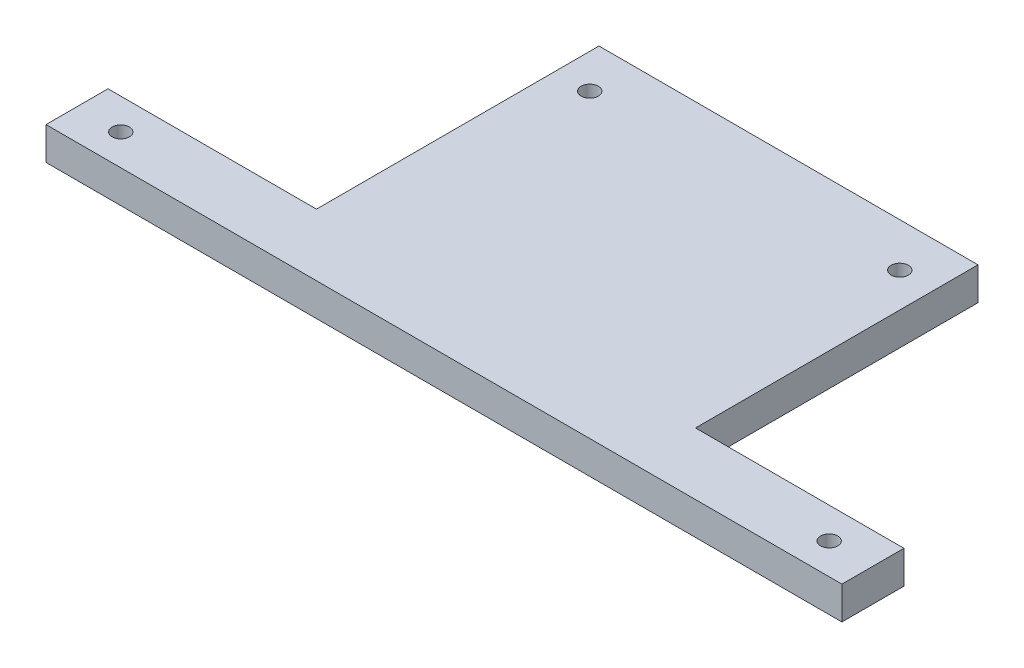
ISO-10303-21;
HEADER;
FILE_DESCRIPTION(('STEP AP214'),'2;1');
FILE_NAME('part.step','',(''),(''),'','','');
FILE_SCHEMA(('AUTOMOTIVE_DESIGN { 1 0 10303 214 1 1 1 1 }'));
ENDSEC;
DATA;
#1=APPLICATION_CONTEXT('core data for automotive mechanical design processes');
#2=APPLICATION_PROTOCOL_DEFINITION('international standard','automotive_design',2000,#1);
#3=PRODUCT_CONTEXT('',#1,'mechanical');
#4=PRODUCT('Part','Part','',(#3));
#5=PRODUCT_RELATED_PRODUCT_CATEGORY('part','',(#4));
#6=PRODUCT_DEFINITION_FORMATION('','',#4);
#7=PRODUCT_DEFINITION_CONTEXT('part definition',#1,'design');
#8=PRODUCT_DEFINITION('design','',#6,#7);
#9=PRODUCT_DEFINITION_SHAPE('','',#8);
#10=(LENGTH_UNIT() NAMED_UNIT(*) SI_UNIT(.MILLI.,.METRE.));
#11=(NAMED_UNIT(*) PLANE_ANGLE_UNIT() SI_UNIT($,.RADIAN.));
#12=(NAMED_UNIT(*) SI_UNIT($,.STERADIAN.) SOLID_ANGLE_UNIT());
#13=UNCERTAINTY_MEASURE_WITH_UNIT(LENGTH_MEASURE(1.E-05),#10,'distance_accuracy_value','');
#14=(GEOMETRIC_REPRESENTATION_CONTEXT(3) GLOBAL_UNCERTAINTY_ASSIGNED_CONTEXT((#13)) GLOBAL_UNIT_ASSIGNED_CONTEXT((#10,
#11,#12)) REPRESENTATION_CONTEXT('',''));
#15=CARTESIAN_POINT('',(0.,0.,0.));
#16=DIRECTION('',(0.,0.,1.));
#17=DIRECTION('',(1.,0.,0.));
#18=AXIS2_PLACEMENT_3D('',#15,#16,#17);
#19=CARTESIAN_POINT('',(-115.5,4.7625,0.999999999999994));
#20=DIRECTION('',(0.,0.,1.));
#21=DIRECTION('',(1.,0.,0.));
#22=AXIS2_PLACEMENT_3D('',#19,#20,#21);
#23=PLANE('',#22);
#24=DIRECTION('',(-1.,0.,0.));
#25=VECTOR('',#24,1.);
#26=CARTESIAN_POINT('',(-115.5,-4.7625,0.999999999999994));
#27=LINE('',#26,#25);
#28=CARTESIAN_POINT('',(-55.,-4.7625,1.));
#29=VERTEX_POINT('',#28);
#30=CARTESIAN_POINT('',(-115.5,-4.7625,0.999999999999994));
#31=VERTEX_POINT('',#30);
#32=EDGE_CURVE('E129',#29,#31,#27,.T.);
#33=ORIENTED_EDGE('',*,*,#32,.T.);
#34=DIRECTION('',(0.,-1.,0.));
#35=VECTOR('',#34,1.);
#36=CARTESIAN_POINT('',(-115.5,4.7625,0.999999999999994));
#37=LINE('',#36,#35);
#38=CARTESIAN_POINT('',(-115.5,4.7625,0.999999999999994));
#39=VERTEX_POINT('',#38);
#40=EDGE_CURVE('E11',#39,#31,#37,.T.);
#41=ORIENTED_EDGE('',*,*,#40,.F.);
#42=DIRECTION('',(-1.,0.,0.));
#43=VECTOR('',#42,1.);
#44=CARTESIAN_POINT('',(-115.5,4.7625,0.999999999999994));
#45=LINE('',#44,#43);
#46=CARTESIAN_POINT('',(-55.,4.7625,1.));
#47=VERTEX_POINT('',#46);
#48=EDGE_CURVE('E144',#47,#39,#45,.T.);
#49=ORIENTED_EDGE('',*,*,#48,.F.);
#50=DIRECTION('',(0.,-1.,0.));
#51=VECTOR('',#50,1.);
#52=CARTESIAN_POINT('',(-55.,4.7625,1.));
#53=LINE('',#52,#51);
#54=EDGE_CURVE('E125',#47,#29,#53,.T.);
#55=ORIENTED_EDGE('',*,*,#54,.T.);
#56=EDGE_LOOP('',(#33,#41,#49,#55));
#57=FACE_BOUND('',#56,.T.);
#58=ADVANCED_FACE('F33',(#57),#23,.F.);
#59=CARTESIAN_POINT('',(-115.5,4.7625,19.));
#60=DIRECTION('',(1.,0.,0.));
#61=DIRECTION('',(0.,0.,-1.));
#62=AXIS2_PLACEMENT_3D('',#59,#60,#61);
#63=PLANE('',#62);
#64=DIRECTION('',(0.,0.,1.));
#65=VECTOR('',#64,1.);
#66=CARTESIAN_POINT('',(-115.5,-4.7625,19.));
#67=LINE('',#66,#65);
#68=CARTESIAN_POINT('',(-115.5,-4.7625,19.));
#69=VERTEX_POINT('',#68);
#70=EDGE_CURVE('E132',#31,#69,#67,.T.);
#71=ORIENTED_EDGE('',*,*,#70,.T.);
#72=DIRECTION('',(0.,-1.,0.));
#73=VECTOR('',#72,1.);
#74=CARTESIAN_POINT('',(-115.5,4.7625,19.));
#75=LINE('',#74,#73);
#76=CARTESIAN_POINT('',(-115.5,4.7625,19.));
#77=VERTEX_POINT('',#76);
#78=EDGE_CURVE('E41',#77,#69,#75,.T.);
#79=ORIENTED_EDGE('',*,*,#78,.F.);
#80=DIRECTION('',(0.,0.,1.));
#81=VECTOR('',#80,1.);
#82=CARTESIAN_POINT('',(-115.5,4.7625,19.));
#83=LINE('',#82,#81);
#84=EDGE_CURVE('E92',#39,#77,#83,.T.);
#85=ORIENTED_EDGE('',*,*,#84,.F.);
#86=ORIENTED_EDGE('',*,*,#40,.T.);
#87=EDGE_LOOP('',(#71,#79,#85,#86));
#88=FACE_BOUND('',#87,.T.);
#89=ADVANCED_FACE('F229',(#88),#63,.F.);
#90=CARTESIAN_POINT('',(115.5,4.7625,19.));
#91=DIRECTION('',(0.,0.,-1.));
#92=DIRECTION('',(-1.,0.,0.));
#93=AXIS2_PLACEMENT_3D('',#90,#91,#92);
#94=PLANE('',#93);
#95=DIRECTION('',(1.,0.,0.));
#96=VECTOR('',#95,1.);
#97=CARTESIAN_POINT('',(115.5,-4.7625,19.));
#98=LINE('',#97,#96);
#99=CARTESIAN_POINT('',(115.5,-4.7625,19.));
#100=VERTEX_POINT('',#99);
#101=EDGE_CURVE('E135',#69,#100,#98,.T.);
#102=ORIENTED_EDGE('',*,*,#101,.T.);
#103=DIRECTION('',(0.,-1.,0.));
#104=VECTOR('',#103,1.);
#105=CARTESIAN_POINT('',(115.5,4.7625,19.));
#106=LINE('',#105,#104);
#107=CARTESIAN_POINT('',(115.5,4.7625,19.));
#108=VERTEX_POINT('',#107);
#109=EDGE_CURVE('E151',#108,#100,#106,.T.);
#110=ORIENTED_EDGE('',*,*,#109,.F.);
#111=DIRECTION('',(1.,0.,0.));
#112=VECTOR('',#111,1.);
#113=CARTESIAN_POINT('',(115.5,4.7625,19.));
#114=LINE('',#113,#112);
#115=EDGE_CURVE('E159',#77,#108,#114,.T.);
#116=ORIENTED_EDGE('',*,*,#115,.F.);
#117=ORIENTED_EDGE('',*,*,#78,.T.);
#118=EDGE_LOOP('',(#102,#110,#116,#117));
#119=FACE_BOUND('',#118,.T.);
#120=ADVANCED_FACE('F157',(#119),#94,.F.);
#121=CARTESIAN_POINT('',(115.5,4.7625,0.999999999999994));
#122=DIRECTION('',(-1.,0.,0.));
#123=DIRECTION('',(0.,0.,1.));
#124=AXIS2_PLACEMENT_3D('',#121,#122,#123);
#125=PLANE('',#124);
#126=DIRECTION('',(0.,0.,-1.));
#127=VECTOR('',#126,1.);
#128=CARTESIAN_POINT('',(115.5,-4.7625,0.999999999999994));
#129=LINE('',#128,#127);
#130=CARTESIAN_POINT('',(115.5,-4.7625,0.999999999999994));
#131=VERTEX_POINT('',#130);
#132=EDGE_CURVE('E137',#100,#131,#129,.T.);
#133=ORIENTED_EDGE('',*,*,#132,.T.);
#134=DIRECTION('',(0.,-1.,0.));
#135=VECTOR('',#134,1.);
#136=CARTESIAN_POINT('',(115.5,4.7625,0.999999999999994));
#137=LINE('',#136,#135);
#138=CARTESIAN_POINT('',(115.5,4.7625,0.999999999999994));
#139=VERTEX_POINT('',#138);
#140=EDGE_CURVE('E148',#139,#131,#137,.T.);
#141=ORIENTED_EDGE('',*,*,#140,.F.);
#142=DIRECTION('',(0.,0.,-1.));
#143=VECTOR('',#142,1.);
#144=CARTESIAN_POINT('',(115.5,4.7625,0.999999999999994));
#145=LINE('',#144,#143);
#146=EDGE_CURVE('E171',#108,#139,#145,.T.);
#147=ORIENTED_EDGE('',*,*,#146,.F.);
#148=ORIENTED_EDGE('',*,*,#109,.T.);
#149=EDGE_LOOP('',(#133,#141,#147,#148));
#150=FACE_BOUND('',#149,.T.);
#151=ADVANCED_FACE('F167',(#150),#125,.F.);
#152=CARTESIAN_POINT('',(55.,4.7625,0.999999999999977));
#153=DIRECTION('',(0.,0.,1.));
#154=DIRECTION('',(1.,0.,0.));
#155=AXIS2_PLACEMENT_3D('',#152,#153,#154);
#156=PLANE('',#155);
#157=DIRECTION('',(-1.,0.,0.));
#158=VECTOR('',#157,1.);
#159=CARTESIAN_POINT('',(55.,-4.7625,0.999999999999977));
#160=LINE('',#159,#158);
#161=CARTESIAN_POINT('',(55.,-4.7625,0.999999999999977));
#162=VERTEX_POINT('',#161);
#163=EDGE_CURVE('E139',#131,#162,#160,.T.);
#164=ORIENTED_EDGE('',*,*,#163,.T.);
#165=DIRECTION('',(0.,-1.,0.));
#166=VECTOR('',#165,1.);
#167=CARTESIAN_POINT('',(55.,4.7625,0.999999999999977));
#168=LINE('',#167,#166);
#169=CARTESIAN_POINT('',(55.,4.7625,0.999999999999977));
#170=VERTEX_POINT('',#169);
#171=EDGE_CURVE('E120',#170,#162,#168,.T.);
#172=ORIENTED_EDGE('',*,*,#171,.F.);
#173=DIRECTION('',(-1.,0.,0.));
#174=VECTOR('',#173,1.);
#175=CARTESIAN_POINT('',(55.,4.7625,0.999999999999977));
#176=LINE('',#175,#174);
#177=EDGE_CURVE('E111',#139,#170,#176,.T.);
#178=ORIENTED_EDGE('',*,*,#177,.F.);
#179=ORIENTED_EDGE('',*,*,#140,.T.);
#180=EDGE_LOOP('',(#164,#172,#178,#179));
#181=FACE_BOUND('',#180,.T.);
#182=ADVANCED_FACE('F170',(#181),#156,.F.);
#183=CARTESIAN_POINT('',(55.,4.7625,-81.));
#184=DIRECTION('',(-1.,0.,0.));
#185=DIRECTION('',(0.,0.,1.));
#186=AXIS2_PLACEMENT_3D('',#183,#184,#185);
#187=PLANE('',#186);
#188=DIRECTION('',(0.,0.,-1.));
#189=VECTOR('',#188,1.);
#190=CARTESIAN_POINT('',(55.,-4.7625,-81.));
#191=LINE('',#190,#189);
#192=CARTESIAN_POINT('',(55.,-4.7625,-81.));
#193=VERTEX_POINT('',#192);
#194=EDGE_CURVE('E119',#162,#193,#191,.T.);
#195=ORIENTED_EDGE('',*,*,#194,.T.);
#196=DIRECTION('',(0.,-1.,0.));
#197=VECTOR('',#196,1.);
#198=CARTESIAN_POINT('',(55.,4.7625,-81.));
#199=LINE('',#198,#197);
#200=CARTESIAN_POINT('',(55.,4.7625,-81.));
#201=VERTEX_POINT('',#200);
#202=EDGE_CURVE('E116',#201,#193,#199,.T.);
#203=ORIENTED_EDGE('',*,*,#202,.F.);
#204=DIRECTION('',(0.,0.,-1.));
#205=VECTOR('',#204,1.);
#206=CARTESIAN_POINT('',(55.,4.7625,-81.));
#207=LINE('',#206,#205);
#208=EDGE_CURVE('E105',#170,#201,#207,.T.);
#209=ORIENTED_EDGE('',*,*,#208,.F.);
#210=ORIENTED_EDGE('',*,*,#171,.T.);
#211=EDGE_LOOP('',(#195,#203,#209,#210));
#212=FACE_BOUND('',#211,.T.);
#213=ADVANCED_FACE('F117',(#212),#187,.F.);
#214=CARTESIAN_POINT('',(-55.,4.7625,-81.));
#215=DIRECTION('',(0.,0.,1.));
#216=DIRECTION('',(1.,0.,0.));
#217=AXIS2_PLACEMENT_3D('',#214,#215,#216);
#218=PLANE('',#217);
#219=DIRECTION('',(-1.,0.,0.));
#220=VECTOR('',#219,1.);
#221=CARTESIAN_POINT('',(-55.,-4.7625,-81.));
#222=LINE('',#221,#220);
#223=CARTESIAN_POINT('',(-55.,-4.7625,-81.));
#224=VERTEX_POINT('',#223);
#225=EDGE_CURVE('E78',#193,#224,#222,.T.);
#226=ORIENTED_EDGE('',*,*,#225,.T.);
#227=DIRECTION('',(0.,-1.,0.));
#228=VECTOR('',#227,1.);
#229=CARTESIAN_POINT('',(-55.,4.7625,-81.));
#230=LINE('',#229,#228);
#231=CARTESIAN_POINT('',(-55.,4.7625,-81.));
#232=VERTEX_POINT('',#231);
#233=EDGE_CURVE('E121',#232,#224,#230,.T.);
#234=ORIENTED_EDGE('',*,*,#233,.F.);
#235=DIRECTION('',(-1.,0.,0.));
#236=VECTOR('',#235,1.);
#237=CARTESIAN_POINT('',(-55.,4.7625,-81.));
#238=LINE('',#237,#236);
#239=EDGE_CURVE('E109',#201,#232,#238,.T.);
#240=ORIENTED_EDGE('',*,*,#239,.F.);
#241=ORIENTED_EDGE('',*,*,#202,.T.);
#242=EDGE_LOOP('',(#226,#234,#240,#241));
#243=FACE_BOUND('',#242,.T.);
#244=ADVANCED_FACE('F123',(#243),#218,.F.);
#245=CARTESIAN_POINT('',(-55.,4.7625,1.));
#246=DIRECTION('',(1.,0.,0.));
#247=DIRECTION('',(0.,0.,-1.));
#248=AXIS2_PLACEMENT_3D('',#245,#246,#247);
#249=PLANE('',#248);
#250=DIRECTION('',(0.,0.,1.));
#251=VECTOR('',#250,1.);
#252=CARTESIAN_POINT('',(-55.,-4.7625,1.));
#253=LINE('',#252,#251);
#254=EDGE_CURVE('E84',#224,#29,#253,.T.);
#255=ORIENTED_EDGE('',*,*,#254,.T.);
#256=ORIENTED_EDGE('',*,*,#54,.F.);
#257=DIRECTION('',(0.,0.,1.));
#258=VECTOR('',#257,1.);
#259=CARTESIAN_POINT('',(-55.,4.7625,1.));
#260=LINE('',#259,#258);
#261=EDGE_CURVE('E49',#232,#47,#260,.T.);
#262=ORIENTED_EDGE('',*,*,#261,.F.);
#263=ORIENTED_EDGE('',*,*,#233,.T.);
#264=EDGE_LOOP('',(#255,#256,#262,#263));
#265=FACE_BOUND('',#264,.T.);
#266=ADVANCED_FACE('F205',(#265),#249,.F.);
#267=CARTESIAN_POINT('',(0.,4.7625,0.));
#268=DIRECTION('',(0.,1.,0.));
#269=DIRECTION('',(0.,0.,1.));
#270=AXIS2_PLACEMENT_3D('',#267,#268,#269);
#271=PLANE('',#270);
#272=CARTESIAN_POINT('',(-45.,4.7625,-68.3));
#273=DIRECTION('',(0.,1.,0.));
#274=DIRECTION('',(0.,0.,1.));
#275=AXIS2_PLACEMENT_3D('',#272,#273,#274);
#276=CIRCLE('',#275,2.5);
#277=CARTESIAN_POINT('',(-45.,4.7625,-65.8));
#278=VERTEX_POINT('',#277);
#279=EDGE_CURVE('E197',#278,#278,#276,.T.);
#280=ORIENTED_EDGE('',*,*,#279,.F.);
#281=EDGE_LOOP('',(#280));
#282=FACE_BOUND('',#281,.T.);
#283=CARTESIAN_POINT('',(45.,4.7625,-68.3));
#284=DIRECTION('',(0.,1.,0.));
#285=DIRECTION('',(0.,0.,1.));
#286=AXIS2_PLACEMENT_3D('',#283,#284,#285);
#287=CIRCLE('',#286,2.5);
#288=CARTESIAN_POINT('',(45.,4.7625,-65.8));
#289=VERTEX_POINT('',#288);
#290=EDGE_CURVE('E191',#289,#289,#287,.T.);
#291=ORIENTED_EDGE('',*,*,#290,.F.);
#292=EDGE_LOOP('',(#291));
#293=FACE_BOUND('',#292,.T.);
#294=CARTESIAN_POINT('',(-102.8,4.7625,10.));
#295=DIRECTION('',(0.,1.,0.));
#296=DIRECTION('',(0.,0.,1.));
#297=AXIS2_PLACEMENT_3D('',#294,#295,#296);
#298=CIRCLE('',#297,2.5);
#299=CARTESIAN_POINT('',(-102.8,4.7625,12.5));
#300=VERTEX_POINT('',#299);
#301=EDGE_CURVE('E185',#300,#300,#298,.T.);
#302=ORIENTED_EDGE('',*,*,#301,.F.);
#303=EDGE_LOOP('',(#302));
#304=FACE_BOUND('',#303,.T.);
#305=CARTESIAN_POINT('',(102.8,4.7625,9.99999999999999));
#306=DIRECTION('',(0.,1.,0.));
#307=DIRECTION('',(0.,0.,1.));
#308=AXIS2_PLACEMENT_3D('',#305,#306,#307);
#309=CIRCLE('',#308,2.5);
#310=CARTESIAN_POINT('',(102.8,4.7625,12.5));
#311=VERTEX_POINT('',#310);
#312=EDGE_CURVE('E179',#311,#311,#309,.T.);
#313=ORIENTED_EDGE('',*,*,#312,.F.);
#314=EDGE_LOOP('',(#313));
#315=FACE_BOUND('',#314,.T.);
#316=ORIENTED_EDGE('',*,*,#48,.T.);
#317=ORIENTED_EDGE('',*,*,#84,.T.);
#318=ORIENTED_EDGE('',*,*,#115,.T.);
#319=ORIENTED_EDGE('',*,*,#146,.T.);
#320=ORIENTED_EDGE('',*,*,#177,.T.);
#321=ORIENTED_EDGE('',*,*,#208,.T.);
#322=ORIENTED_EDGE('',*,*,#239,.T.);
#323=ORIENTED_EDGE('',*,*,#261,.T.);
#324=EDGE_LOOP('',(#316,#317,#318,#319,#320,#321,#322,#323));
#325=FACE_BOUND('',#324,.T.);
#326=ADVANCED_FACE('F107',(#282,#293,#304,#315,#325),#271,.T.);
#327=CARTESIAN_POINT('',(0.,-4.7625,0.));
#328=DIRECTION('',(0.,1.,0.));
#329=DIRECTION('',(0.,0.,1.));
#330=AXIS2_PLACEMENT_3D('',#327,#328,#329);
#331=PLANE('',#330);
#332=CARTESIAN_POINT('',(-45.,-4.7625,-68.3));
#333=DIRECTION('',(0.,1.,0.));
#334=DIRECTION('',(0.,0.,1.));
#335=AXIS2_PLACEMENT_3D('',#332,#333,#334);
#336=CIRCLE('',#335,2.5);
#337=CARTESIAN_POINT('',(-45.,-4.7625,-65.8));
#338=VERTEX_POINT('',#337);
#339=EDGE_CURVE('E194',#338,#338,#336,.T.);
#340=ORIENTED_EDGE('',*,*,#339,.T.);
#341=EDGE_LOOP('',(#340));
#342=FACE_BOUND('',#341,.T.);
#343=CARTESIAN_POINT('',(45.,-4.7625,-68.3));
#344=DIRECTION('',(0.,1.,0.));
#345=DIRECTION('',(0.,0.,1.));
#346=AXIS2_PLACEMENT_3D('',#343,#344,#345);
#347=CIRCLE('',#346,2.5);
#348=CARTESIAN_POINT('',(45.,-4.7625,-65.8));
#349=VERTEX_POINT('',#348);
#350=EDGE_CURVE('E188',#349,#349,#347,.T.);
#351=ORIENTED_EDGE('',*,*,#350,.T.);
#352=EDGE_LOOP('',(#351));
#353=FACE_BOUND('',#352,.T.);
#354=CARTESIAN_POINT('',(-102.8,-4.7625,10.));
#355=DIRECTION('',(0.,1.,0.));
#356=DIRECTION('',(0.,0.,1.));
#357=AXIS2_PLACEMENT_3D('',#354,#355,#356);
#358=CIRCLE('',#357,2.5);
#359=CARTESIAN_POINT('',(-102.8,-4.7625,12.5));
#360=VERTEX_POINT('',#359);
#361=EDGE_CURVE('E182',#360,#360,#358,.T.);
#362=ORIENTED_EDGE('',*,*,#361,.T.);
#363=EDGE_LOOP('',(#362));
#364=FACE_BOUND('',#363,.T.);
#365=CARTESIAN_POINT('',(102.8,-4.7625,9.99999999999999));
#366=DIRECTION('',(0.,1.,0.));
#367=DIRECTION('',(0.,0.,1.));
#368=AXIS2_PLACEMENT_3D('',#365,#366,#367);
#369=CIRCLE('',#368,2.5);
#370=CARTESIAN_POINT('',(102.8,-4.7625,12.5));
#371=VERTEX_POINT('',#370);
#372=EDGE_CURVE('E133',#371,#371,#369,.T.);
#373=ORIENTED_EDGE('',*,*,#372,.T.);
#374=EDGE_LOOP('',(#373));
#375=FACE_BOUND('',#374,.T.);
#376=ORIENTED_EDGE('',*,*,#32,.F.);
#377=ORIENTED_EDGE('',*,*,#254,.F.);
#378=ORIENTED_EDGE('',*,*,#225,.F.);
#379=ORIENTED_EDGE('',*,*,#194,.F.);
#380=ORIENTED_EDGE('',*,*,#163,.F.);
#381=ORIENTED_EDGE('',*,*,#132,.F.);
#382=ORIENTED_EDGE('',*,*,#101,.F.);
#383=ORIENTED_EDGE('',*,*,#70,.F.);
#384=EDGE_LOOP('',(#376,#377,#378,#379,#380,#381,#382,#383));
#385=FACE_BOUND('',#384,.T.);
#386=ADVANCED_FACE('F163',(#342,#353,#364,#375,#385),#331,.F.);
#387=CARTESIAN_POINT('',(102.8,4.7625,9.99999999999999));
#388=DIRECTION('',(0.,1.,0.));
#389=DIRECTION('',(0.,0.,1.));
#390=AXIS2_PLACEMENT_3D('',#387,#388,#389);
#391=CYLINDRICAL_SURFACE('',#390,2.5);
#392=ORIENTED_EDGE('',*,*,#372,.F.);
#393=EDGE_LOOP('',(#392));
#394=FACE_BOUND('',#393,.T.);
#395=ORIENTED_EDGE('',*,*,#312,.T.);
#396=EDGE_LOOP('',(#395));
#397=FACE_BOUND('',#396,.T.);
#398=ADVANCED_FACE('F213',(#394,#397),#391,.F.);
#399=CARTESIAN_POINT('',(-102.8,4.7625,10.));
#400=DIRECTION('',(0.,1.,0.));
#401=DIRECTION('',(0.,0.,1.));
#402=AXIS2_PLACEMENT_3D('',#399,#400,#401);
#403=CYLINDRICAL_SURFACE('',#402,2.5);
#404=ORIENTED_EDGE('',*,*,#361,.F.);
#405=EDGE_LOOP('',(#404));
#406=FACE_BOUND('',#405,.T.);
#407=ORIENTED_EDGE('',*,*,#301,.T.);
#408=EDGE_LOOP('',(#407));
#409=FACE_BOUND('',#408,.T.);
#410=ADVANCED_FACE('F215',(#406,#409),#403,.F.);
#411=CARTESIAN_POINT('',(45.,4.7625,-68.3));
#412=DIRECTION('',(0.,1.,0.));
#413=DIRECTION('',(0.,0.,1.));
#414=AXIS2_PLACEMENT_3D('',#411,#412,#413);
#415=CYLINDRICAL_SURFACE('',#414,2.5);
#416=ORIENTED_EDGE('',*,*,#350,.F.);
#417=EDGE_LOOP('',(#416));
#418=FACE_BOUND('',#417,.T.);
#419=ORIENTED_EDGE('',*,*,#290,.T.);
#420=EDGE_LOOP('',(#419));
#421=FACE_BOUND('',#420,.T.);
#422=ADVANCED_FACE('F222',(#418,#421),#415,.F.);
#423=CARTESIAN_POINT('',(-45.,4.7625,-68.3));
#424=DIRECTION('',(0.,1.,0.));
#425=DIRECTION('',(0.,0.,1.));
#426=AXIS2_PLACEMENT_3D('',#423,#424,#425);
#427=CYLINDRICAL_SURFACE('',#426,2.5);
#428=ORIENTED_EDGE('',*,*,#339,.F.);
#429=EDGE_LOOP('',(#428));
#430=FACE_BOUND('',#429,.T.);
#431=ORIENTED_EDGE('',*,*,#279,.T.);
#432=EDGE_LOOP('',(#431));
#433=FACE_BOUND('',#432,.T.);
#434=ADVANCED_FACE('F201',(#430,#433),#427,.F.);
#435=CLOSED_SHELL('',(#58,#89,#120,#151,#182,#213,#244,#266,#326,#386,#398,#410,#422,#434));
#436=MANIFOLD_SOLID_BREP('B2',#435);
#437=ADVANCED_BREP_SHAPE_REPRESENTATION('',(#18,#436),#14);
#438=SHAPE_DEFINITION_REPRESENTATION(#9,#437);
ENDSEC;
END-ISO-10303-21;
